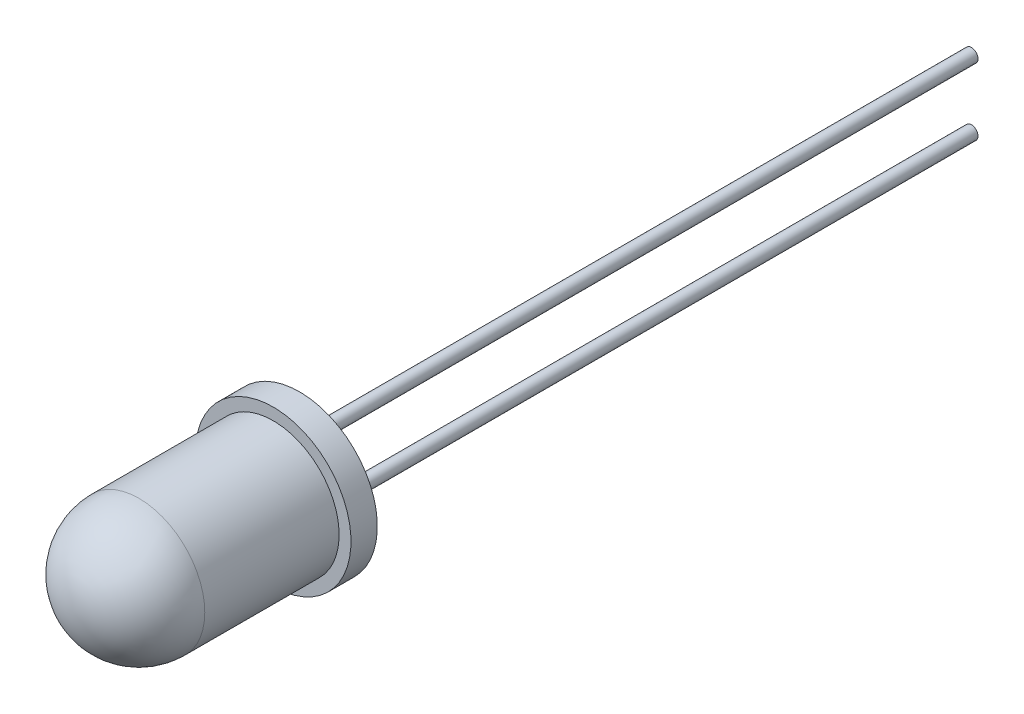
ISO-10303-21;
HEADER;
FILE_DESCRIPTION(('STEP AP214'),'2;1');
FILE_NAME('part.step','',(''),(''),'','','');
FILE_SCHEMA(('AUTOMOTIVE_DESIGN { 1 0 10303 214 1 1 1 1 }'));
ENDSEC;
DATA;
#1=APPLICATION_CONTEXT('core data for automotive mechanical design processes');
#2=APPLICATION_PROTOCOL_DEFINITION('international standard','automotive_design',2000,#1);
#3=PRODUCT_CONTEXT('',#1,'mechanical');
#4=PRODUCT('Part','Part','',(#3));
#5=PRODUCT_RELATED_PRODUCT_CATEGORY('part','',(#4));
#6=PRODUCT_DEFINITION_FORMATION('','',#4);
#7=PRODUCT_DEFINITION_CONTEXT('part definition',#1,'design');
#8=PRODUCT_DEFINITION('design','',#6,#7);
#9=PRODUCT_DEFINITION_SHAPE('','',#8);
#10=(LENGTH_UNIT() NAMED_UNIT(*) SI_UNIT(.MILLI.,.METRE.));
#11=(NAMED_UNIT(*) PLANE_ANGLE_UNIT() SI_UNIT($,.RADIAN.));
#12=(NAMED_UNIT(*) SI_UNIT($,.STERADIAN.) SOLID_ANGLE_UNIT());
#13=UNCERTAINTY_MEASURE_WITH_UNIT(LENGTH_MEASURE(1.E-05),#10,'distance_accuracy_value','');
#14=(GEOMETRIC_REPRESENTATION_CONTEXT(3) GLOBAL_UNCERTAINTY_ASSIGNED_CONTEXT((#13)) GLOBAL_UNIT_ASSIGNED_CONTEXT((#10,
#11,#12)) REPRESENTATION_CONTEXT('',''));
#15=CARTESIAN_POINT('',(0.,0.,0.));
#16=DIRECTION('',(0.,0.,1.));
#17=DIRECTION('',(1.,0.,0.));
#18=AXIS2_PLACEMENT_3D('',#15,#16,#17);
#19=CARTESIAN_POINT('',(0.,0.,7.6));
#20=DIRECTION('',(0.,0.,-1.));
#21=DIRECTION('',(-1.,0.,0.));
#22=AXIS2_PLACEMENT_3D('',#19,#20,#21);
#23=CYLINDRICAL_SURFACE('',#22,2.5);
#24=CARTESIAN_POINT('',(0.,0.,5.1));
#25=DIRECTION('',(0.,0.,-1.));
#26=DIRECTION('',(-1.,0.,0.));
#27=AXIS2_PLACEMENT_3D('',#24,#25,#26);
#28=CIRCLE('',#27,2.5);
#29=CARTESIAN_POINT('',(-2.5,0.,5.1));
#30=VERTEX_POINT('',#29);
#31=EDGE_CURVE('E43',#30,#30,#28,.T.);
#32=CARTESIAN_POINT('',(0.,0.,0.));
#33=DIRECTION('',(0.,0.,-1.));
#34=DIRECTION('',(-1.,0.,0.));
#35=AXIS2_PLACEMENT_3D('',#32,#33,#34);
#36=CIRCLE('',#35,2.5);
#37=CARTESIAN_POINT('',(-2.5,0.,0.));
#38=VERTEX_POINT('',#37);
#39=EDGE_CURVE('E47',#38,#38,#36,.T.);
#40=CARTESIAN_POINT('',(-2.5,0.,5.1));
#41=CARTESIAN_POINT('',(-2.5,0.,5.046875));
#42=CARTESIAN_POINT('',(-2.5,0.,4.99375));
#43=CARTESIAN_POINT('',(-2.5,0.,4.8875));
#44=CARTESIAN_POINT('',(-2.5,0.,4.834375));
#45=CARTESIAN_POINT('',(-2.5,0.,4.728125));
#46=CARTESIAN_POINT('',(-2.5,0.,4.675));
#47=CARTESIAN_POINT('',(-2.5,0.,4.56875));
#48=CARTESIAN_POINT('',(-2.5,0.,4.515625));
#49=CARTESIAN_POINT('',(-2.5,0.,4.409375));
#50=CARTESIAN_POINT('',(-2.5,0.,4.35625));
#51=CARTESIAN_POINT('',(-2.5,0.,4.25));
#52=CARTESIAN_POINT('',(-2.5,0.,4.196875));
#53=CARTESIAN_POINT('',(-2.5,0.,4.090625));
#54=CARTESIAN_POINT('',(-2.5,0.,4.0375));
#55=CARTESIAN_POINT('',(-2.5,0.,3.93125));
#56=CARTESIAN_POINT('',(-2.5,0.,3.878125));
#57=CARTESIAN_POINT('',(-2.5,0.,3.771875));
#58=CARTESIAN_POINT('',(-2.5,0.,3.71875));
#59=CARTESIAN_POINT('',(-2.5,0.,3.6125));
#60=CARTESIAN_POINT('',(-2.5,0.,3.559375));
#61=CARTESIAN_POINT('',(-2.5,0.,3.453125));
#62=CARTESIAN_POINT('',(-2.5,0.,3.4));
#63=CARTESIAN_POINT('',(-2.5,0.,3.29375));
#64=CARTESIAN_POINT('',(-2.5,0.,3.240625));
#65=CARTESIAN_POINT('',(-2.5,0.,3.134375));
#66=CARTESIAN_POINT('',(-2.5,0.,3.08125));
#67=CARTESIAN_POINT('',(-2.5,0.,2.975));
#68=CARTESIAN_POINT('',(-2.5,0.,2.921875));
#69=CARTESIAN_POINT('',(-2.5,0.,2.815625));
#70=CARTESIAN_POINT('',(-2.5,0.,2.7625));
#71=CARTESIAN_POINT('',(-2.5,0.,2.65625));
#72=CARTESIAN_POINT('',(-2.5,0.,2.603125));
#73=CARTESIAN_POINT('',(-2.5,0.,2.496875));
#74=CARTESIAN_POINT('',(-2.5,0.,2.44375));
#75=CARTESIAN_POINT('',(-2.5,0.,2.3375));
#76=CARTESIAN_POINT('',(-2.5,0.,2.284375));
#77=CARTESIAN_POINT('',(-2.5,0.,2.178125));
#78=CARTESIAN_POINT('',(-2.5,0.,2.125));
#79=CARTESIAN_POINT('',(-2.5,0.,2.01875));
#80=CARTESIAN_POINT('',(-2.5,0.,1.965625));
#81=CARTESIAN_POINT('',(-2.5,0.,1.859375));
#82=CARTESIAN_POINT('',(-2.5,0.,1.80625));
#83=CARTESIAN_POINT('',(-2.5,0.,1.7));
#84=CARTESIAN_POINT('',(-2.5,0.,1.646875));
#85=CARTESIAN_POINT('',(-2.5,0.,1.540625));
#86=CARTESIAN_POINT('',(-2.5,0.,1.4875));
#87=CARTESIAN_POINT('',(-2.5,0.,1.38125));
#88=CARTESIAN_POINT('',(-2.5,0.,1.328125));
#89=CARTESIAN_POINT('',(-2.5,0.,1.221875));
#90=CARTESIAN_POINT('',(-2.5,0.,1.16875));
#91=CARTESIAN_POINT('',(-2.5,0.,1.0625));
#92=CARTESIAN_POINT('',(-2.5,0.,1.009375));
#93=CARTESIAN_POINT('',(-2.5,0.,0.903125));
#94=CARTESIAN_POINT('',(-2.5,0.,0.85));
#95=CARTESIAN_POINT('',(-2.5,0.,0.74375));
#96=CARTESIAN_POINT('',(-2.5,0.,0.690625));
#97=CARTESIAN_POINT('',(-2.5,0.,0.584375));
#98=CARTESIAN_POINT('',(-2.5,0.,0.53125));
#99=CARTESIAN_POINT('',(-2.5,0.,0.425));
#100=CARTESIAN_POINT('',(-2.5,0.,0.371875));
#101=CARTESIAN_POINT('',(-2.5,0.,0.265625));
#102=CARTESIAN_POINT('',(-2.5,0.,0.2125));
#103=CARTESIAN_POINT('',(-2.5,0.,0.10625));
#104=CARTESIAN_POINT('',(-2.5,0.,0.0531249999999999));
#105=CARTESIAN_POINT('',(-2.5,0.,0.));
#106=B_SPLINE_CURVE_WITH_KNOTS('',3,(#40,#41,#42,#43,#44,#45,#46,#47,#48,#49,#50,#51,#52,#53,
#54,#55,#56,#57,#58,#59,#60,#61,#62,#63,#64,#65,#66,#67,#68,#69,#70,#71,#72,#73,#74,#75,#76,#77,
#78,#79,#80,#81,#82,#83,#84,#85,#86,#87,#88,#89,#90,#91,#92,#93,#94,#95,#96,#97,#98,#99,#100,
#101,#102,#103,#104,#105),.UNSPECIFIED.,.F.,.F.,(4,2,2,2,2,2,2,2,2,2,2,2,2,2,2,2,2,2,2,2,2,2,2,
2,2,2,2,2,2,2,2,2,4),(0.,0.159375,0.31875,0.478124999999999,0.637499999999999,0.796875,0.95625,
1.115625,1.275,1.434375,1.59375,1.753125,1.9125,2.071875,2.23125,2.390625,2.55,2.709375,2.86875,
3.028125,3.1875,3.346875,3.50625,3.665625,3.825,3.984375,4.14375,4.303125,4.4625,4.621875,
4.78125,4.940625,5.1),.UNSPECIFIED.);
#107=EDGE_CURVE('BSEAM36',#30,#38,#106,.T.);
#108=ORIENTED_EDGE('',*,*,#31,.T.);
#109=ORIENTED_EDGE('',*,*,#39,.F.);
#110=ORIENTED_EDGE('',*,*,#107,.T.);
#111=ORIENTED_EDGE('',*,*,#107,.F.);
#112=EDGE_LOOP('',(#108,#110,#109,#111));
#113=FACE_BOUND('',#112,.T.);
#114=ADVANCED_FACE('F36',(#113),#23,.T.);
#115=CARTESIAN_POINT('',(0.,0.,5.1));
#116=DIRECTION('',(0.,0.,1.));
#117=DIRECTION('',(1.,0.,0.));
#118=AXIS2_PLACEMENT_3D('',#115,#116,#117);
#119=SPHERICAL_SURFACE('',#118,2.5);
#120=ORIENTED_EDGE('',*,*,#31,.F.);
#121=EDGE_LOOP('',(#120));
#122=FACE_BOUND('',#121,.T.);
#123=ADVANCED_FACE('F104',(#122),#119,.T.);
#124=CARTESIAN_POINT('',(0.,0.,-1.));
#125=DIRECTION('',(0.,0.,1.));
#126=DIRECTION('',(1.,0.,0.));
#127=AXIS2_PLACEMENT_3D('',#124,#125,#126);
#128=CYLINDRICAL_SURFACE('',#127,2.95);
#129=CARTESIAN_POINT('',(0.,0.,-1.));
#130=DIRECTION('',(0.,0.,-1.));
#131=DIRECTION('',(-1.,0.,0.));
#132=AXIS2_PLACEMENT_3D('',#129,#130,#131);
#133=CIRCLE('',#132,2.95);
#134=CARTESIAN_POINT('',(-2.95,0.,-1.));
#135=VERTEX_POINT('',#134);
#136=EDGE_CURVE('E51',#135,#135,#133,.T.);
#137=ORIENTED_EDGE('',*,*,#136,.F.);
#138=EDGE_LOOP('',(#137));
#139=FACE_BOUND('',#138,.T.);
#140=CARTESIAN_POINT('',(0.,0.,0.));
#141=DIRECTION('',(0.,0.,-1.));
#142=DIRECTION('',(-1.,0.,0.));
#143=AXIS2_PLACEMENT_3D('',#140,#141,#142);
#144=CIRCLE('',#143,2.95);
#145=CARTESIAN_POINT('',(-2.95,0.,0.));
#146=VERTEX_POINT('',#145);
#147=EDGE_CURVE('E54',#146,#146,#144,.T.);
#148=ORIENTED_EDGE('',*,*,#147,.T.);
#149=EDGE_LOOP('',(#148));
#150=FACE_BOUND('',#149,.T.);
#151=ADVANCED_FACE('F109',(#139,#150),#128,.T.);
#152=CARTESIAN_POINT('',(0.,0.,-1.));
#153=DIRECTION('',(0.,0.,-1.));
#154=DIRECTION('',(-1.,0.,0.));
#155=AXIS2_PLACEMENT_3D('',#152,#153,#154);
#156=PLANE('',#155);
#157=CARTESIAN_POINT('',(0.,0.,-1.));
#158=DIRECTION('',(0.,0.,-1.));
#159=DIRECTION('',(-1.,0.,0.));
#160=AXIS2_PLACEMENT_3D('',#157,#158,#159);
#161=CIRCLE('',#160,2.5);
#162=CARTESIAN_POINT('',(-2.5,0.,-1.));
#163=VERTEX_POINT('',#162);
#164=EDGE_CURVE('E57',#163,#163,#161,.T.);
#165=ORIENTED_EDGE('',*,*,#164,.F.);
#166=EDGE_LOOP('',(#165));
#167=FACE_BOUND('',#166,.T.);
#168=ORIENTED_EDGE('',*,*,#136,.T.);
#169=EDGE_LOOP('',(#168));
#170=FACE_BOUND('',#169,.T.);
#171=ADVANCED_FACE('F115',(#167,#170),#156,.T.);
#172=CARTESIAN_POINT('',(0.,0.,0.));
#173=DIRECTION('',(0.,0.,-1.));
#174=DIRECTION('',(-1.,0.,0.));
#175=AXIS2_PLACEMENT_3D('',#172,#173,#174);
#176=PLANE('',#175);
#177=ORIENTED_EDGE('',*,*,#39,.T.);
#178=EDGE_LOOP('',(#177));
#179=FACE_BOUND('',#178,.T.);
#180=ORIENTED_EDGE('',*,*,#147,.F.);
#181=EDGE_LOOP('',(#180));
#182=FACE_BOUND('',#181,.T.);
#183=ADVANCED_FACE('F87',(#179,#182),#176,.F.);
#184=CARTESIAN_POINT('',(0.,0.,-1.5));
#185=DIRECTION('',(0.,0.,-1.));
#186=DIRECTION('',(-1.,0.,0.));
#187=AXIS2_PLACEMENT_3D('',#184,#185,#186);
#188=PLANE('',#187);
#189=CARTESIAN_POINT('',(0.,-1.27,-1.5));
#190=DIRECTION('',(0.,0.,-1.));
#191=DIRECTION('',(-1.,0.,0.));
#192=AXIS2_PLACEMENT_3D('',#189,#190,#191);
#193=CIRCLE('',#192,0.25);
#194=CARTESIAN_POINT('',(-0.25,-1.27,-1.5));
#195=VERTEX_POINT('',#194);
#196=EDGE_CURVE('E69',#195,#195,#193,.T.);
#197=ORIENTED_EDGE('',*,*,#196,.F.);
#198=EDGE_LOOP('',(#197));
#199=FACE_BOUND('',#198,.T.);
#200=CARTESIAN_POINT('',(0.,1.27,-1.5));
#201=DIRECTION('',(0.,0.,-1.));
#202=DIRECTION('',(-1.,0.,0.));
#203=AXIS2_PLACEMENT_3D('',#200,#201,#202);
#204=CIRCLE('',#203,0.25);
#205=CARTESIAN_POINT('',(-0.25,1.27,-1.5));
#206=VERTEX_POINT('',#205);
#207=EDGE_CURVE('E63',#206,#206,#204,.T.);
#208=ORIENTED_EDGE('',*,*,#207,.F.);
#209=EDGE_LOOP('',(#208));
#210=FACE_BOUND('',#209,.T.);
#211=CARTESIAN_POINT('',(0.,0.,-1.5));
#212=DIRECTION('',(0.,0.,-1.));
#213=DIRECTION('',(-1.,0.,0.));
#214=AXIS2_PLACEMENT_3D('',#211,#212,#213);
#215=CIRCLE('',#214,2.);
#216=CARTESIAN_POINT('',(-2.,0.,-1.5));
#217=VERTEX_POINT('',#216);
#218=EDGE_CURVE('E10',#217,#217,#215,.T.);
#219=ORIENTED_EDGE('',*,*,#218,.T.);
#220=EDGE_LOOP('',(#219));
#221=FACE_BOUND('',#220,.T.);
#222=ADVANCED_FACE('F84',(#199,#210,#221),#188,.T.);
#223=CARTESIAN_POINT('',(0.,0.,-1.5));
#224=DIRECTION('',(0.,0.,1.));
#225=DIRECTION('',(1.,0.,0.));
#226=AXIS2_PLACEMENT_3D('',#223,#224,#225);
#227=CONICAL_SURFACE('',#226,2.,0.785398163397447);
#228=ORIENTED_EDGE('',*,*,#164,.T.);
#229=EDGE_LOOP('',(#228));
#230=FACE_BOUND('',#229,.T.);
#231=ORIENTED_EDGE('',*,*,#218,.F.);
#232=EDGE_LOOP('',(#231));
#233=FACE_BOUND('',#232,.T.);
#234=ADVANCED_FACE('F38',(#230,#233),#227,.T.);
#235=CARTESIAN_POINT('',(0.,1.27,-26.5));
#236=DIRECTION('',(0.,0.,1.));
#237=DIRECTION('',(1.,0.,0.));
#238=AXIS2_PLACEMENT_3D('',#235,#236,#237);
#239=CYLINDRICAL_SURFACE('',#238,0.25);
#240=CARTESIAN_POINT('',(0.,1.27,-26.5));
#241=DIRECTION('',(0.,0.,-1.));
#242=DIRECTION('',(-1.,0.,0.));
#243=AXIS2_PLACEMENT_3D('',#240,#241,#242);
#244=CIRCLE('',#243,0.25);
#245=CARTESIAN_POINT('',(-0.25,1.27,-26.5));
#246=VERTEX_POINT('',#245);
#247=EDGE_CURVE('E62',#246,#246,#244,.T.);
#248=ORIENTED_EDGE('',*,*,#247,.F.);
#249=EDGE_LOOP('',(#248));
#250=FACE_BOUND('',#249,.T.);
#251=ORIENTED_EDGE('',*,*,#207,.T.);
#252=EDGE_LOOP('',(#251));
#253=FACE_BOUND('',#252,.T.);
#254=ADVANCED_FACE('F91',(#250,#253),#239,.T.);
#255=CARTESIAN_POINT('',(0.,1.27,-26.5));
#256=DIRECTION('',(0.,0.,-1.));
#257=DIRECTION('',(-1.,0.,0.));
#258=AXIS2_PLACEMENT_3D('',#255,#256,#257);
#259=PLANE('',#258);
#260=ORIENTED_EDGE('',*,*,#247,.T.);
#261=EDGE_LOOP('',(#260));
#262=FACE_BOUND('',#261,.T.);
#263=ADVANCED_FACE('F80',(#262),#259,.T.);
#264=CARTESIAN_POINT('',(0.,-1.27,-26.5));
#265=DIRECTION('',(0.,0.,1.));
#266=DIRECTION('',(1.,0.,0.));
#267=AXIS2_PLACEMENT_3D('',#264,#265,#266);
#268=CYLINDRICAL_SURFACE('',#267,0.25);
#269=CARTESIAN_POINT('',(0.,-1.27,-26.5));
#270=DIRECTION('',(0.,0.,-1.));
#271=DIRECTION('',(-1.,0.,0.));
#272=AXIS2_PLACEMENT_3D('',#269,#270,#271);
#273=CIRCLE('',#272,0.25);
#274=CARTESIAN_POINT('',(-0.25,-1.27,-26.5));
#275=VERTEX_POINT('',#274);
#276=EDGE_CURVE('E66',#275,#275,#273,.T.);
#277=ORIENTED_EDGE('',*,*,#276,.F.);
#278=EDGE_LOOP('',(#277));
#279=FACE_BOUND('',#278,.T.);
#280=ORIENTED_EDGE('',*,*,#196,.T.);
#281=EDGE_LOOP('',(#280));
#282=FACE_BOUND('',#281,.T.);
#283=ADVANCED_FACE('F77',(#279,#282),#268,.T.);
#284=CARTESIAN_POINT('',(0.,-1.27,-26.5));
#285=DIRECTION('',(0.,0.,-1.));
#286=DIRECTION('',(-1.,0.,0.));
#287=AXIS2_PLACEMENT_3D('',#284,#285,#286);
#288=PLANE('',#287);
#289=ORIENTED_EDGE('',*,*,#276,.T.);
#290=EDGE_LOOP('',(#289));
#291=FACE_BOUND('',#290,.T.);
#292=ADVANCED_FACE('F75',(#291),#288,.T.);
#293=CLOSED_SHELL('',(#114,#123,#151,#171,#183,#222,#234,#254,#263,#283,#292));
#294=MANIFOLD_SOLID_BREP('B2',#293);
#295=ADVANCED_BREP_SHAPE_REPRESENTATION('',(#18,#294),#14);
#296=SHAPE_DEFINITION_REPRESENTATION(#9,#295);
ENDSEC;
END-ISO-10303-21;
